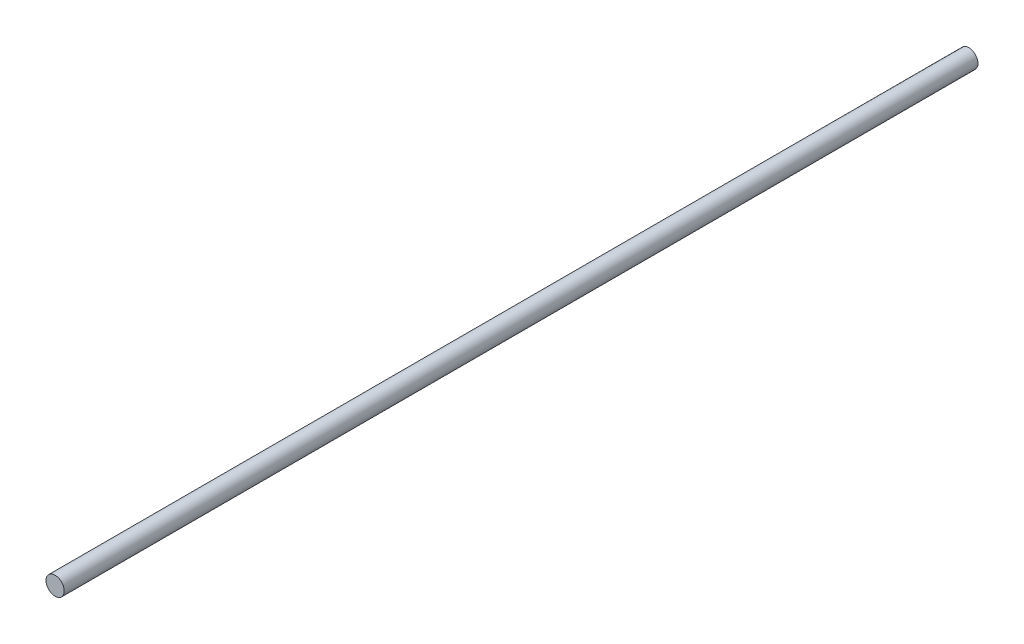
ISO-10303-21;
HEADER;
FILE_DESCRIPTION(('STEP AP214'),'2;1');
FILE_NAME('part.step','',(''),(''),'','','');
FILE_SCHEMA(('AUTOMOTIVE_DESIGN { 1 0 10303 214 1 1 1 1 }'));
ENDSEC;
DATA;
#1=APPLICATION_CONTEXT('core data for automotive mechanical design processes');
#2=APPLICATION_PROTOCOL_DEFINITION('international standard','automotive_design',2000,#1);
#3=PRODUCT_CONTEXT('',#1,'mechanical');
#4=PRODUCT('Part','Part','',(#3));
#5=PRODUCT_RELATED_PRODUCT_CATEGORY('part','',(#4));
#6=PRODUCT_DEFINITION_FORMATION('','',#4);
#7=PRODUCT_DEFINITION_CONTEXT('part definition',#1,'design');
#8=PRODUCT_DEFINITION('design','',#6,#7);
#9=PRODUCT_DEFINITION_SHAPE('','',#8);
#10=(LENGTH_UNIT() NAMED_UNIT(*) SI_UNIT(.MILLI.,.METRE.));
#11=(NAMED_UNIT(*) PLANE_ANGLE_UNIT() SI_UNIT($,.RADIAN.));
#12=(NAMED_UNIT(*) SI_UNIT($,.STERADIAN.) SOLID_ANGLE_UNIT());
#13=UNCERTAINTY_MEASURE_WITH_UNIT(LENGTH_MEASURE(1.E-05),#10,'distance_accuracy_value','');
#14=(GEOMETRIC_REPRESENTATION_CONTEXT(3) GLOBAL_UNCERTAINTY_ASSIGNED_CONTEXT((#13)) GLOBAL_UNIT_ASSIGNED_CONTEXT((#10,
#11,#12)) REPRESENTATION_CONTEXT('',''));
#15=CARTESIAN_POINT('',(0.,0.,0.));
#16=DIRECTION('',(0.,0.,1.));
#17=DIRECTION('',(1.,0.,0.));
#18=AXIS2_PLACEMENT_3D('',#15,#16,#17);
#19=CARTESIAN_POINT('',(0.,0.,200.));
#20=DIRECTION('',(0.,0.,-1.));
#21=DIRECTION('',(-1.,0.,0.));
#22=AXIS2_PLACEMENT_3D('',#19,#20,#21);
#23=CYLINDRICAL_SURFACE('',#22,2.);
#24=CARTESIAN_POINT('',(0.,0.,200.));
#25=DIRECTION('',(0.,0.,1.));
#26=DIRECTION('',(1.,0.,0.));
#27=AXIS2_PLACEMENT_3D('',#24,#25,#26);
#28=CIRCLE('',#27,2.);
#29=CARTESIAN_POINT('',(2.,0.,200.));
#30=VERTEX_POINT('',#29);
#31=EDGE_CURVE('E10',#30,#30,#28,.T.);
#32=ORIENTED_EDGE('',*,*,#31,.F.);
#33=EDGE_LOOP('',(#32));
#34=FACE_BOUND('',#33,.T.);
#35=CARTESIAN_POINT('',(0.,0.,0.));
#36=DIRECTION('',(0.,0.,1.));
#37=DIRECTION('',(1.,0.,0.));
#38=AXIS2_PLACEMENT_3D('',#35,#36,#37);
#39=CIRCLE('',#38,2.);
#40=CARTESIAN_POINT('',(2.,0.,0.));
#41=VERTEX_POINT('',#40);
#42=EDGE_CURVE('E36',#41,#41,#39,.T.);
#43=ORIENTED_EDGE('',*,*,#42,.T.);
#44=EDGE_LOOP('',(#43));
#45=FACE_BOUND('',#44,.T.);
#46=ADVANCED_FACE('F33',(#34,#45),#23,.T.);
#47=CARTESIAN_POINT('',(0.,0.,200.));
#48=DIRECTION('',(0.,0.,1.));
#49=DIRECTION('',(1.,0.,0.));
#50=AXIS2_PLACEMENT_3D('',#47,#48,#49);
#51=PLANE('',#50);
#52=ORIENTED_EDGE('',*,*,#31,.T.);
#53=EDGE_LOOP('',(#52));
#54=FACE_BOUND('',#53,.T.);
#55=ADVANCED_FACE('F48',(#54),#51,.T.);
#56=CARTESIAN_POINT('',(0.,0.,0.));
#57=DIRECTION('',(0.,0.,1.));
#58=DIRECTION('',(1.,0.,0.));
#59=AXIS2_PLACEMENT_3D('',#56,#57,#58);
#60=PLANE('',#59);
#61=ORIENTED_EDGE('',*,*,#42,.F.);
#62=EDGE_LOOP('',(#61));
#63=FACE_BOUND('',#62,.T.);
#64=ADVANCED_FACE('F46',(#63),#60,.F.);
#65=CLOSED_SHELL('',(#46,#55,#64));
#66=MANIFOLD_SOLID_BREP('B2',#65);
#67=ADVANCED_BREP_SHAPE_REPRESENTATION('',(#18,#66),#14);
#68=SHAPE_DEFINITION_REPRESENTATION(#9,#67);
ENDSEC;
END-ISO-10303-21;
